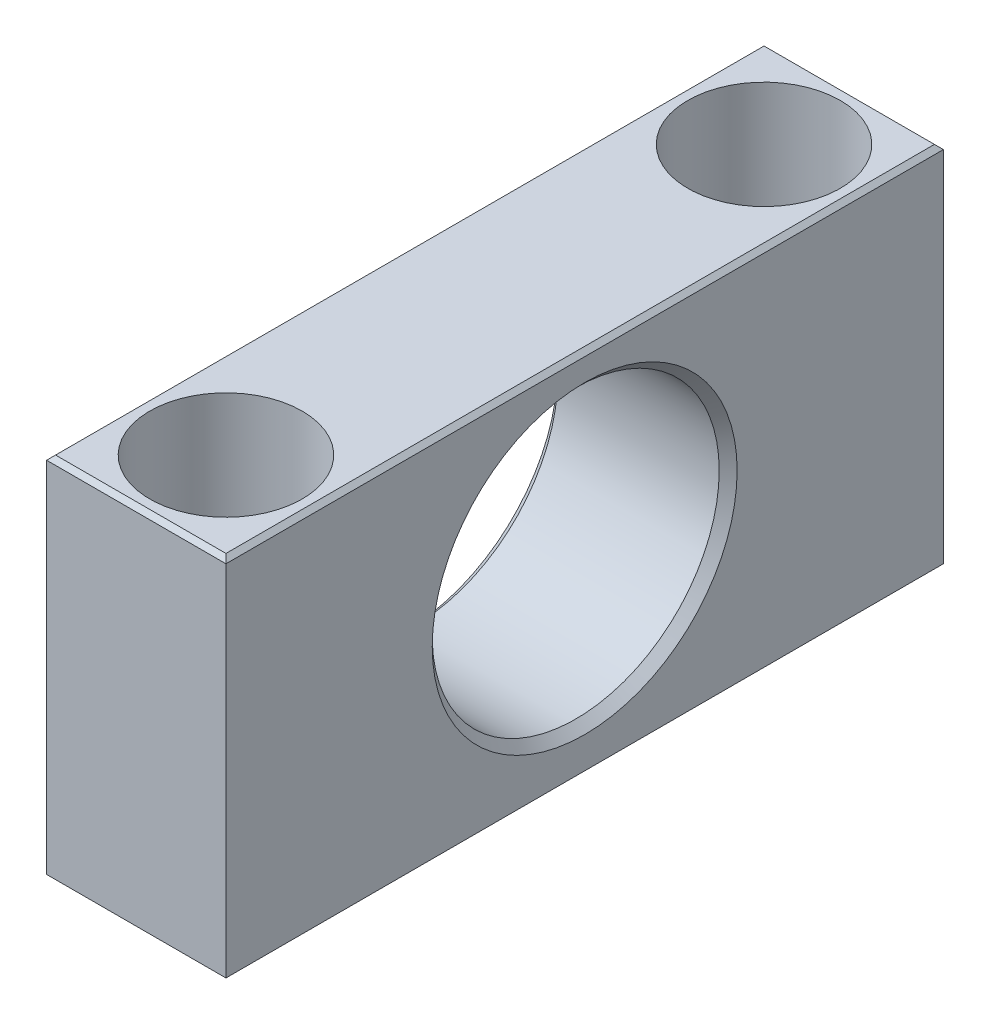
ISO-10303-21;
HEADER;
FILE_DESCRIPTION(('STEP AP214'),'2;1');
FILE_NAME('part.step','',(''),(''),'','','');
FILE_SCHEMA(('AUTOMOTIVE_DESIGN { 1 0 10303 214 1 1 1 1 }'));
ENDSEC;
DATA;
#1=APPLICATION_CONTEXT('core data for automotive mechanical design processes');
#2=APPLICATION_PROTOCOL_DEFINITION('international standard','automotive_design',2000,#1);
#3=PRODUCT_CONTEXT('',#1,'mechanical');
#4=PRODUCT('Part','Part','',(#3));
#5=PRODUCT_RELATED_PRODUCT_CATEGORY('part','',(#4));
#6=PRODUCT_DEFINITION_FORMATION('','',#4);
#7=PRODUCT_DEFINITION_CONTEXT('part definition',#1,'design');
#8=PRODUCT_DEFINITION('design','',#6,#7);
#9=PRODUCT_DEFINITION_SHAPE('','',#8);
#10=(LENGTH_UNIT() NAMED_UNIT(*) SI_UNIT(.MILLI.,.METRE.));
#11=(NAMED_UNIT(*) PLANE_ANGLE_UNIT() SI_UNIT($,.RADIAN.));
#12=(NAMED_UNIT(*) SI_UNIT($,.STERADIAN.) SOLID_ANGLE_UNIT());
#13=UNCERTAINTY_MEASURE_WITH_UNIT(LENGTH_MEASURE(1.E-05),#10,'distance_accuracy_value','');
#14=(GEOMETRIC_REPRESENTATION_CONTEXT(3) GLOBAL_UNCERTAINTY_ASSIGNED_CONTEXT((#13)) GLOBAL_UNIT_ASSIGNED_CONTEXT((#10,
#11,#12)) REPRESENTATION_CONTEXT('',''));
#15=CARTESIAN_POINT('',(0.,0.,0.));
#16=DIRECTION('',(0.,0.,1.));
#17=DIRECTION('',(1.,0.,0.));
#18=AXIS2_PLACEMENT_3D('',#15,#16,#17);
#19=CARTESIAN_POINT('',(17.,-1.,30.));
#20=DIRECTION('',(0.,-1.,0.));
#21=DIRECTION('',(0.,0.,-1.));
#22=AXIS2_PLACEMENT_3D('',#19,#20,#21);
#23=PLANE('',#22);
#24=CARTESIAN_POINT('',(10.,-1.,30.));
#25=DIRECTION('',(0.,-1.,0.));
#26=DIRECTION('',(0.,0.,-1.));
#27=AXIS2_PLACEMENT_3D('',#24,#25,#26);
#28=CIRCLE('',#27,5.5);
#29=CARTESIAN_POINT('',(10.,-1.,24.5));
#30=VERTEX_POINT('',#29);
#31=EDGE_CURVE('E145',#30,#30,#28,.T.);
#32=ORIENTED_EDGE('',*,*,#31,.T.);
#33=EDGE_LOOP('',(#32));
#34=FACE_BOUND('',#33,.T.);
#35=CARTESIAN_POINT('',(10.,-0.999999999999999,30.));
#36=DIRECTION('',(0.,-1.,0.));
#37=DIRECTION('',(0.,0.,-1.));
#38=AXIS2_PLACEMENT_3D('',#35,#36,#37);
#39=CIRCLE('',#38,8.5);
#40=CARTESIAN_POINT('',(10.,-0.999999999999999,21.5));
#41=VERTEX_POINT('',#40);
#42=EDGE_CURVE('E147',#41,#41,#39,.F.);
#43=ORIENTED_EDGE('',*,*,#42,.T.);
#44=EDGE_LOOP('',(#43));
#45=FACE_BOUND('',#44,.T.);
#46=ADVANCED_FACE('F17',(#34,#45),#23,.F.);
#47=CARTESIAN_POINT('',(17.,-1.,-30.));
#48=DIRECTION('',(0.,-1.,0.));
#49=DIRECTION('',(0.,0.,-1.));
#50=AXIS2_PLACEMENT_3D('',#47,#48,#49);
#51=PLANE('',#50);
#52=CARTESIAN_POINT('',(10.,-1.,-30.));
#53=DIRECTION('',(0.,-1.,0.));
#54=DIRECTION('',(0.,0.,-1.));
#55=AXIS2_PLACEMENT_3D('',#52,#53,#54);
#56=CIRCLE('',#55,5.5);
#57=CARTESIAN_POINT('',(10.,-1.,-35.5));
#58=VERTEX_POINT('',#57);
#59=EDGE_CURVE('E124',#58,#58,#56,.T.);
#60=ORIENTED_EDGE('',*,*,#59,.T.);
#61=EDGE_LOOP('',(#60));
#62=FACE_BOUND('',#61,.T.);
#63=CARTESIAN_POINT('',(10.,-0.999999999999999,-30.));
#64=DIRECTION('',(0.,-1.,0.));
#65=DIRECTION('',(0.,0.,-1.));
#66=AXIS2_PLACEMENT_3D('',#63,#64,#65);
#67=CIRCLE('',#66,8.5);
#68=CARTESIAN_POINT('',(10.,-0.999999999999999,-38.5));
#69=VERTEX_POINT('',#68);
#70=EDGE_CURVE('E20',#69,#69,#67,.F.);
#71=ORIENTED_EDGE('',*,*,#70,.T.);
#72=EDGE_LOOP('',(#71));
#73=FACE_BOUND('',#72,.T.);
#74=ADVANCED_FACE('F154',(#62,#73),#51,.F.);
#75=CARTESIAN_POINT('',(10.,9.5,-30.));
#76=DIRECTION('',(0.,-1.,0.));
#77=DIRECTION('',(0.,0.,-1.));
#78=AXIS2_PLACEMENT_3D('',#75,#76,#77);
#79=CYLINDRICAL_SURFACE('',#78,8.5);
#80=CARTESIAN_POINT('',(10.,20.,-30.));
#81=DIRECTION('',(0.,-1.,0.));
#82=DIRECTION('',(0.,0.,-1.));
#83=AXIS2_PLACEMENT_3D('',#80,#81,#82);
#84=CIRCLE('',#83,8.5);
#85=CARTESIAN_POINT('',(10.,20.,-38.5));
#86=VERTEX_POINT('',#85);
#87=EDGE_CURVE('E109',#86,#86,#84,.T.);
#88=ORIENTED_EDGE('',*,*,#87,.F.);
#89=EDGE_LOOP('',(#88));
#90=FACE_BOUND('',#89,.T.);
#91=ORIENTED_EDGE('',*,*,#70,.F.);
#92=EDGE_LOOP('',(#91));
#93=FACE_BOUND('',#92,.T.);
#94=ADVANCED_FACE('F156',(#90,#93),#79,.F.);
#95=CARTESIAN_POINT('',(10.,9.5,30.));
#96=DIRECTION('',(0.,-1.,0.));
#97=DIRECTION('',(0.,0.,-1.));
#98=AXIS2_PLACEMENT_3D('',#95,#96,#97);
#99=CYLINDRICAL_SURFACE('',#98,8.5);
#100=CARTESIAN_POINT('',(10.,20.,30.));
#101=DIRECTION('',(0.,-1.,0.));
#102=DIRECTION('',(0.,0.,-1.));
#103=AXIS2_PLACEMENT_3D('',#100,#101,#102);
#104=CIRCLE('',#103,8.5);
#105=CARTESIAN_POINT('',(10.,20.,21.5));
#106=VERTEX_POINT('',#105);
#107=EDGE_CURVE('E106',#106,#106,#104,.T.);
#108=ORIENTED_EDGE('',*,*,#107,.F.);
#109=EDGE_LOOP('',(#108));
#110=FACE_BOUND('',#109,.T.);
#111=ORIENTED_EDGE('',*,*,#42,.F.);
#112=EDGE_LOOP('',(#111));
#113=FACE_BOUND('',#112,.T.);
#114=ADVANCED_FACE('F158',(#110,#113),#99,.F.);
#115=CARTESIAN_POINT('',(0.,0.,0.));
#116=DIRECTION('',(-1.,0.,0.));
#117=DIRECTION('',(0.,0.,1.));
#118=AXIS2_PLACEMENT_3D('',#115,#116,#117);
#119=CONICAL_SURFACE('',#118,17.,0.785398163397448);
#120=CARTESIAN_POINT('',(0.,0.,0.));
#121=DIRECTION('',(-1.,0.,0.));
#122=DIRECTION('',(0.,0.,1.));
#123=AXIS2_PLACEMENT_3D('',#120,#121,#122);
#124=CIRCLE('',#123,17.);
#125=CARTESIAN_POINT('',(0.,0.,17.));
#126=VERTEX_POINT('',#125);
#127=EDGE_CURVE('E136',#126,#126,#124,.F.);
#128=ORIENTED_EDGE('',*,*,#127,.F.);
#129=EDGE_LOOP('',(#128));
#130=FACE_BOUND('',#129,.T.);
#131=CARTESIAN_POINT('',(0.999999999999999,0.,0.));
#132=DIRECTION('',(1.,0.,0.));
#133=DIRECTION('',(0.,0.,-1.));
#134=AXIS2_PLACEMENT_3D('',#131,#132,#133);
#135=CIRCLE('',#134,16.);
#136=CARTESIAN_POINT('',(0.999999999999999,0.,-16.));
#137=VERTEX_POINT('',#136);
#138=EDGE_CURVE('E94',#137,#137,#135,.T.);
#139=ORIENTED_EDGE('',*,*,#138,.T.);
#140=EDGE_LOOP('',(#139));
#141=FACE_BOUND('',#140,.T.);
#142=ADVANCED_FACE('F166',(#130,#141),#119,.F.);
#143=CARTESIAN_POINT('',(0.5,20.,40.));
#144=DIRECTION('',(-0.707106781186548,0.707106781186548,0.));
#145=DIRECTION('',(-0.707106781186548,-0.707106781186548,0.));
#146=AXIS2_PLACEMENT_3D('',#143,#144,#145);
#147=PLANE('',#146);
#148=DIRECTION('',(-0.577350269189626,-0.577350269189626,-0.577350269189626));
#149=VECTOR('',#148,1.);
#150=CARTESIAN_POINT('',(0.499999999999987,20.,-39.5));
#151=LINE('',#150,#149);
#152=CARTESIAN_POINT('',(0.499999999999993,20.,-39.5));
#153=VERTEX_POINT('',#152);
#154=CARTESIAN_POINT('',(0.,19.5,-40.));
#155=VERTEX_POINT('',#154);
#156=EDGE_CURVE('E85',#153,#155,#151,.T.);
#157=ORIENTED_EDGE('',*,*,#156,.T.);
#158=DIRECTION('',(0.,0.,1.));
#159=VECTOR('',#158,1.);
#160=CARTESIAN_POINT('',(0.,19.5,40.));
#161=LINE('',#160,#159);
#162=CARTESIAN_POINT('',(0.,19.5,40.));
#163=VERTEX_POINT('',#162);
#164=EDGE_CURVE('E481',#163,#155,#161,.F.);
#165=ORIENTED_EDGE('',*,*,#164,.F.);
#166=DIRECTION('',(0.577350269189626,0.577350269189626,-0.577350269189626));
#167=VECTOR('',#166,1.);
#168=CARTESIAN_POINT('',(0.,19.5,40.));
#169=LINE('',#168,#167);
#170=CARTESIAN_POINT('',(0.499999999999993,20.,39.5));
#171=VERTEX_POINT('',#170);
#172=EDGE_CURVE('E79',#163,#171,#169,.T.);
#173=ORIENTED_EDGE('',*,*,#172,.T.);
#174=DIRECTION('',(0.,0.,1.));
#175=VECTOR('',#174,1.);
#176=CARTESIAN_POINT('',(0.5,20.,40.));
#177=LINE('',#176,#175);
#178=EDGE_CURVE('E96',#153,#171,#177,.T.);
#179=ORIENTED_EDGE('',*,*,#178,.F.);
#180=EDGE_LOOP('',(#157,#165,#173,#179));
#181=FACE_BOUND('',#180,.T.);
#182=ADVANCED_FACE('F97',(#181),#147,.T.);
#183=CARTESIAN_POINT('',(0.,-20.5,40.));
#184=DIRECTION('',(-0.707106781186548,-0.707106781186548,0.));
#185=DIRECTION('',(0.707106781186548,-0.707106781186548,0.));
#186=AXIS2_PLACEMENT_3D('',#183,#184,#185);
#187=PLANE('',#186);
#188=DIRECTION('',(0.577350269189626,-0.577350269189626,0.577350269189626));
#189=VECTOR('',#188,1.);
#190=CARTESIAN_POINT('',(0.,-20.5,-40.));
#191=LINE('',#190,#189);
#192=CARTESIAN_POINT('',(0.,-20.5,-40.));
#193=VERTEX_POINT('',#192);
#194=CARTESIAN_POINT('',(0.499999999999985,-21.,-39.5));
#195=VERTEX_POINT('',#194);
#196=EDGE_CURVE('E115',#193,#195,#191,.T.);
#197=ORIENTED_EDGE('',*,*,#196,.T.);
#198=DIRECTION('',(0.,0.,-1.));
#199=VECTOR('',#198,1.);
#200=CARTESIAN_POINT('',(0.5,-21.,40.));
#201=LINE('',#200,#199);
#202=CARTESIAN_POINT('',(0.499999999999993,-21.,39.5));
#203=VERTEX_POINT('',#202);
#204=EDGE_CURVE('E135',#203,#195,#201,.T.);
#205=ORIENTED_EDGE('',*,*,#204,.F.);
#206=DIRECTION('',(-0.577350269189626,0.577350269189626,0.577350269189626));
#207=VECTOR('',#206,1.);
#208=CARTESIAN_POINT('',(0.499999999999987,-21.,39.5));
#209=LINE('',#208,#207);
#210=CARTESIAN_POINT('',(0.,-20.5,40.));
#211=VERTEX_POINT('',#210);
#212=EDGE_CURVE('E100',#203,#211,#209,.T.);
#213=ORIENTED_EDGE('',*,*,#212,.T.);
#214=DIRECTION('',(0.,0.,1.));
#215=VECTOR('',#214,1.);
#216=CARTESIAN_POINT('',(0.,-20.5,40.));
#217=LINE('',#216,#215);
#218=EDGE_CURVE('E138',#193,#211,#217,.T.);
#219=ORIENTED_EDGE('',*,*,#218,.F.);
#220=EDGE_LOOP('',(#197,#205,#213,#219));
#221=FACE_BOUND('',#220,.T.);
#222=ADVANCED_FACE('F234',(#221),#187,.T.);
#223=CARTESIAN_POINT('',(10.,-11.,30.));
#224=DIRECTION('',(0.,-1.,0.));
#225=DIRECTION('',(0.,0.,-1.));
#226=AXIS2_PLACEMENT_3D('',#223,#224,#225);
#227=CYLINDRICAL_SURFACE('',#226,5.5);
#228=CARTESIAN_POINT('',(10.,-21.,30.));
#229=DIRECTION('',(0.,-1.,0.));
#230=DIRECTION('',(0.,0.,-1.));
#231=AXIS2_PLACEMENT_3D('',#228,#229,#230);
#232=CIRCLE('',#231,5.5);
#233=CARTESIAN_POINT('',(10.,-21.,24.5));
#234=VERTEX_POINT('',#233);
#235=EDGE_CURVE('E132',#234,#234,#232,.F.);
#236=ORIENTED_EDGE('',*,*,#235,.F.);
#237=EDGE_LOOP('',(#236));
#238=FACE_BOUND('',#237,.T.);
#239=ORIENTED_EDGE('',*,*,#31,.F.);
#240=EDGE_LOOP('',(#239));
#241=FACE_BOUND('',#240,.T.);
#242=ADVANCED_FACE('F230',(#238,#241),#227,.F.);
#243=CARTESIAN_POINT('',(10.,-11.,-30.));
#244=DIRECTION('',(0.,-1.,0.));
#245=DIRECTION('',(0.,0.,-1.));
#246=AXIS2_PLACEMENT_3D('',#243,#244,#245);
#247=CYLINDRICAL_SURFACE('',#246,5.5);
#248=CARTESIAN_POINT('',(10.,-21.,-30.));
#249=DIRECTION('',(0.,-1.,0.));
#250=DIRECTION('',(0.,0.,-1.));
#251=AXIS2_PLACEMENT_3D('',#248,#249,#250);
#252=CIRCLE('',#251,5.5);
#253=CARTESIAN_POINT('',(10.,-21.,-35.5));
#254=VERTEX_POINT('',#253);
#255=EDGE_CURVE('E121',#254,#254,#252,.F.);
#256=ORIENTED_EDGE('',*,*,#255,.F.);
#257=EDGE_LOOP('',(#256));
#258=FACE_BOUND('',#257,.T.);
#259=ORIENTED_EDGE('',*,*,#59,.F.);
#260=EDGE_LOOP('',(#259));
#261=FACE_BOUND('',#260,.T.);
#262=ADVANCED_FACE('F226',(#258,#261),#247,.F.);
#263=CARTESIAN_POINT('',(10.,0.,0.));
#264=DIRECTION('',(1.,0.,0.));
#265=DIRECTION('',(0.,0.,-1.));
#266=AXIS2_PLACEMENT_3D('',#263,#264,#265);
#267=CYLINDRICAL_SURFACE('',#266,16.);
#268=CARTESIAN_POINT('',(19.,0.,0.));
#269=DIRECTION('',(1.,0.,0.));
#270=DIRECTION('',(0.,1.,0.));
#271=AXIS2_PLACEMENT_3D('',#268,#269,#270);
#272=CIRCLE('',#271,16.);
#273=CARTESIAN_POINT('',(19.,16.,0.));
#274=VERTEX_POINT('',#273);
#275=EDGE_CURVE('E118',#274,#274,#272,.T.);
#276=ORIENTED_EDGE('',*,*,#275,.T.);
#277=EDGE_LOOP('',(#276));
#278=FACE_BOUND('',#277,.T.);
#279=ORIENTED_EDGE('',*,*,#138,.F.);
#280=EDGE_LOOP('',(#279));
#281=FACE_BOUND('',#280,.T.);
#282=ADVANCED_FACE('F223',(#278,#281),#267,.F.);
#283=CARTESIAN_POINT('',(40.,20.,-39.5));
#284=DIRECTION('',(0.,-0.707106781186548,0.707106781186548));
#285=DIRECTION('',(0.,-0.707106781186548,-0.707106781186548));
#286=AXIS2_PLACEMENT_3D('',#283,#284,#285);
#287=PLANE('',#286);
#288=DIRECTION('',(1.,0.,0.));
#289=VECTOR('',#288,1.);
#290=CARTESIAN_POINT('',(0.,19.5,-40.));
#291=LINE('',#290,#289);
#292=CARTESIAN_POINT('',(20.,19.5,-40.));
#293=VERTEX_POINT('',#292);
#294=EDGE_CURVE('E91',#293,#155,#291,.F.);
#295=ORIENTED_EDGE('',*,*,#294,.T.);
#296=ORIENTED_EDGE('',*,*,#156,.F.);
#297=DIRECTION('',(1.,0.,0.));
#298=VECTOR('',#297,1.);
#299=CARTESIAN_POINT('',(19.5,20.,-39.5));
#300=LINE('',#299,#298);
#301=CARTESIAN_POINT('',(19.5,20.,-39.5));
#302=VERTEX_POINT('',#301);
#303=EDGE_CURVE('E88',#302,#153,#300,.F.);
#304=ORIENTED_EDGE('',*,*,#303,.F.);
#305=DIRECTION('',(-0.577350269189626,0.577350269189626,0.577350269189626));
#306=VECTOR('',#305,1.);
#307=CARTESIAN_POINT('',(20.,19.5,-40.));
#308=LINE('',#307,#306);
#309=EDGE_CURVE('E93',#293,#302,#308,.T.);
#310=ORIENTED_EDGE('',*,*,#309,.F.);
#311=EDGE_LOOP('',(#295,#296,#304,#310));
#312=FACE_BOUND('',#311,.T.);
#313=ADVANCED_FACE('F86',(#312),#287,.F.);
#314=CARTESIAN_POINT('',(40.,-20.5,-40.));
#315=DIRECTION('',(0.,0.707106781186548,0.707106781186548));
#316=DIRECTION('',(0.,-0.707106781186548,0.707106781186548));
#317=AXIS2_PLACEMENT_3D('',#314,#315,#316);
#318=PLANE('',#317);
#319=DIRECTION('',(1.,0.,0.));
#320=VECTOR('',#319,1.);
#321=CARTESIAN_POINT('',(0.5,-21.,-39.5));
#322=LINE('',#321,#320);
#323=CARTESIAN_POINT('',(19.5,-21.,-39.5));
#324=VERTEX_POINT('',#323);
#325=EDGE_CURVE('E476',#195,#324,#322,.T.);
#326=ORIENTED_EDGE('',*,*,#325,.F.);
#327=ORIENTED_EDGE('',*,*,#196,.F.);
#328=DIRECTION('',(1.,0.,0.));
#329=VECTOR('',#328,1.);
#330=CARTESIAN_POINT('',(0.,-20.5,-40.));
#331=LINE('',#330,#329);
#332=CARTESIAN_POINT('',(20.,-20.5,-40.));
#333=VERTEX_POINT('',#332);
#334=EDGE_CURVE('E512',#193,#333,#331,.T.);
#335=ORIENTED_EDGE('',*,*,#334,.T.);
#336=DIRECTION('',(0.577350269189626,0.577350269189626,-0.577350269189626));
#337=VECTOR('',#336,1.);
#338=CARTESIAN_POINT('',(19.5,-21.,-39.5));
#339=LINE('',#338,#337);
#340=EDGE_CURVE('E113',#324,#333,#339,.T.);
#341=ORIENTED_EDGE('',*,*,#340,.F.);
#342=EDGE_LOOP('',(#326,#327,#335,#341));
#343=FACE_BOUND('',#342,.T.);
#344=ADVANCED_FACE('F217',(#343),#318,.F.);
#345=CARTESIAN_POINT('',(19.5,20.,40.));
#346=DIRECTION('',(0.,1.,0.));
#347=DIRECTION('',(0.,0.,1.));
#348=AXIS2_PLACEMENT_3D('',#345,#346,#347);
#349=PLANE('',#348);
#350=DIRECTION('',(1.,0.,0.));
#351=VECTOR('',#350,1.);
#352=CARTESIAN_POINT('',(40.,20.,39.5));
#353=LINE('',#352,#351);
#354=CARTESIAN_POINT('',(19.5,20.,39.5));
#355=VERTEX_POINT('',#354);
#356=EDGE_CURVE('E139',#171,#355,#353,.T.);
#357=ORIENTED_EDGE('',*,*,#356,.T.);
#358=DIRECTION('',(0.,0.,1.));
#359=VECTOR('',#358,1.);
#360=CARTESIAN_POINT('',(19.5,20.,40.));
#361=LINE('',#360,#359);
#362=EDGE_CURVE('E105',#302,#355,#361,.T.);
#363=ORIENTED_EDGE('',*,*,#362,.F.);
#364=ORIENTED_EDGE('',*,*,#303,.T.);
#365=ORIENTED_EDGE('',*,*,#178,.T.);
#366=EDGE_LOOP('',(#357,#363,#364,#365));
#367=FACE_BOUND('',#366,.T.);
#368=ORIENTED_EDGE('',*,*,#107,.T.);
#369=EDGE_LOOP('',(#368));
#370=FACE_BOUND('',#369,.T.);
#371=ORIENTED_EDGE('',*,*,#87,.T.);
#372=EDGE_LOOP('',(#371));
#373=FACE_BOUND('',#372,.T.);
#374=ADVANCED_FACE('F102',(#367,#370,#373),#349,.T.);
#375=CARTESIAN_POINT('',(40.,-21.,39.5));
#376=DIRECTION('',(0.,0.707106781186548,-0.707106781186548));
#377=DIRECTION('',(0.,0.707106781186548,0.707106781186548));
#378=AXIS2_PLACEMENT_3D('',#375,#376,#377);
#379=PLANE('',#378);
#380=DIRECTION('',(1.,0.,0.));
#381=VECTOR('',#380,1.);
#382=CARTESIAN_POINT('',(0.,-20.5,40.));
#383=LINE('',#382,#381);
#384=CARTESIAN_POINT('',(20.,-20.5,40.));
#385=VERTEX_POINT('',#384);
#386=EDGE_CURVE('E492',#211,#385,#383,.T.);
#387=ORIENTED_EDGE('',*,*,#386,.F.);
#388=ORIENTED_EDGE('',*,*,#212,.F.);
#389=DIRECTION('',(1.,0.,0.));
#390=VECTOR('',#389,1.);
#391=CARTESIAN_POINT('',(0.5,-21.,39.5));
#392=LINE('',#391,#390);
#393=CARTESIAN_POINT('',(19.5,-21.,39.5));
#394=VERTEX_POINT('',#393);
#395=EDGE_CURVE('E480',#394,#203,#392,.F.);
#396=ORIENTED_EDGE('',*,*,#395,.F.);
#397=DIRECTION('',(-0.577350269189626,-0.577350269189626,-0.577350269189626));
#398=VECTOR('',#397,1.);
#399=CARTESIAN_POINT('',(20.,-20.5,40.));
#400=LINE('',#399,#398);
#401=EDGE_CURVE('E35',#385,#394,#400,.T.);
#402=ORIENTED_EDGE('',*,*,#401,.F.);
#403=EDGE_LOOP('',(#387,#388,#396,#402));
#404=FACE_BOUND('',#403,.T.);
#405=ADVANCED_FACE('F211',(#404),#379,.F.);
#406=CARTESIAN_POINT('',(40.,19.5,40.));
#407=DIRECTION('',(0.,-0.707106781186548,-0.707106781186548));
#408=DIRECTION('',(0.,0.707106781186548,-0.707106781186548));
#409=AXIS2_PLACEMENT_3D('',#406,#407,#408);
#410=PLANE('',#409);
#411=ORIENTED_EDGE('',*,*,#356,.F.);
#412=ORIENTED_EDGE('',*,*,#172,.F.);
#413=DIRECTION('',(1.,0.,0.));
#414=VECTOR('',#413,1.);
#415=CARTESIAN_POINT('',(0.,19.5,40.));
#416=LINE('',#415,#414);
#417=CARTESIAN_POINT('',(20.,19.5,40.));
#418=VERTEX_POINT('',#417);
#419=EDGE_CURVE('E496',#418,#163,#416,.F.);
#420=ORIENTED_EDGE('',*,*,#419,.F.);
#421=DIRECTION('',(0.577350269189626,-0.577350269189626,0.577350269189626));
#422=VECTOR('',#421,1.);
#423=CARTESIAN_POINT('',(19.5,20.,39.5));
#424=LINE('',#423,#422);
#425=EDGE_CURVE('E497',#355,#418,#424,.T.);
#426=ORIENTED_EDGE('',*,*,#425,.F.);
#427=EDGE_LOOP('',(#411,#412,#420,#426));
#428=FACE_BOUND('',#427,.T.);
#429=ADVANCED_FACE('F207',(#428),#410,.F.);
#430=CARTESIAN_POINT('',(0.,19.5,40.));
#431=DIRECTION('',(-1.,0.,0.));
#432=DIRECTION('',(0.,0.,1.));
#433=AXIS2_PLACEMENT_3D('',#430,#431,#432);
#434=PLANE('',#433);
#435=DIRECTION('',(0.,1.,0.));
#436=VECTOR('',#435,1.);
#437=CARTESIAN_POINT('',(0.,0.,40.));
#438=LINE('',#437,#436);
#439=EDGE_CURVE('E500',#163,#211,#438,.F.);
#440=ORIENTED_EDGE('',*,*,#439,.F.);
#441=ORIENTED_EDGE('',*,*,#164,.T.);
#442=DIRECTION('',(0.,1.,0.));
#443=VECTOR('',#442,1.);
#444=CARTESIAN_POINT('',(0.,0.,-40.));
#445=LINE('',#444,#443);
#446=EDGE_CURVE('E503',#155,#193,#445,.F.);
#447=ORIENTED_EDGE('',*,*,#446,.T.);
#448=ORIENTED_EDGE('',*,*,#218,.T.);
#449=EDGE_LOOP('',(#440,#441,#447,#448));
#450=FACE_BOUND('',#449,.T.);
#451=ORIENTED_EDGE('',*,*,#127,.T.);
#452=EDGE_LOOP('',(#451));
#453=FACE_BOUND('',#452,.T.);
#454=ADVANCED_FACE('F203',(#450,#453),#434,.T.);
#455=CARTESIAN_POINT('',(0.5,-21.,40.));
#456=DIRECTION('',(0.,-1.,0.));
#457=DIRECTION('',(0.,0.,-1.));
#458=AXIS2_PLACEMENT_3D('',#455,#456,#457);
#459=PLANE('',#458);
#460=ORIENTED_EDGE('',*,*,#255,.T.);
#461=EDGE_LOOP('',(#460));
#462=FACE_BOUND('',#461,.T.);
#463=ORIENTED_EDGE('',*,*,#235,.T.);
#464=EDGE_LOOP('',(#463));
#465=FACE_BOUND('',#464,.T.);
#466=ORIENTED_EDGE('',*,*,#395,.T.);
#467=ORIENTED_EDGE('',*,*,#204,.T.);
#468=ORIENTED_EDGE('',*,*,#325,.T.);
#469=DIRECTION('',(0.,0.,1.));
#470=VECTOR('',#469,1.);
#471=CARTESIAN_POINT('',(19.5,-21.,40.));
#472=LINE('',#471,#470);
#473=EDGE_CURVE('E129',#394,#324,#472,.F.);
#474=ORIENTED_EDGE('',*,*,#473,.F.);
#475=EDGE_LOOP('',(#466,#467,#468,#474));
#476=FACE_BOUND('',#475,.T.);
#477=ADVANCED_FACE('F199',(#462,#465,#476),#459,.T.);
#478=CARTESIAN_POINT('',(20.,0.,0.));
#479=DIRECTION('',(1.,0.,0.));
#480=DIRECTION('',(0.,0.,-1.));
#481=AXIS2_PLACEMENT_3D('',#478,#479,#480);
#482=CONICAL_SURFACE('',#481,17.,0.785398163397448);
#483=CARTESIAN_POINT('',(20.,0.,0.));
#484=DIRECTION('',(1.,0.,0.));
#485=DIRECTION('',(0.,0.,-1.));
#486=AXIS2_PLACEMENT_3D('',#483,#484,#485);
#487=CIRCLE('',#486,17.);
#488=CARTESIAN_POINT('',(20.,0.,-17.));
#489=VERTEX_POINT('',#488);
#490=EDGE_CURVE('E125',#489,#489,#487,.F.);
#491=ORIENTED_EDGE('',*,*,#490,.F.);
#492=EDGE_LOOP('',(#491));
#493=FACE_BOUND('',#492,.T.);
#494=ORIENTED_EDGE('',*,*,#275,.F.);
#495=EDGE_LOOP('',(#494));
#496=FACE_BOUND('',#495,.T.);
#497=ADVANCED_FACE('F195',(#493,#496),#482,.F.);
#498=CARTESIAN_POINT('',(0.,0.,-40.));
#499=DIRECTION('',(0.,0.,1.));
#500=DIRECTION('',(1.,0.,0.));
#501=AXIS2_PLACEMENT_3D('',#498,#499,#500);
#502=PLANE('',#501);
#503=ORIENTED_EDGE('',*,*,#446,.F.);
#504=ORIENTED_EDGE('',*,*,#294,.F.);
#505=DIRECTION('',(0.,1.,0.));
#506=VECTOR('',#505,1.);
#507=CARTESIAN_POINT('',(20.,-20.5,-40.));
#508=LINE('',#507,#506);
#509=EDGE_CURVE('E128',#333,#293,#508,.T.);
#510=ORIENTED_EDGE('',*,*,#509,.F.);
#511=ORIENTED_EDGE('',*,*,#334,.F.);
#512=EDGE_LOOP('',(#503,#504,#510,#511));
#513=FACE_BOUND('',#512,.T.);
#514=ADVANCED_FACE('F191',(#513),#502,.F.);
#515=CARTESIAN_POINT('',(20.,19.5,40.));
#516=DIRECTION('',(0.707106781186548,0.707106781186548,0.));
#517=DIRECTION('',(-0.707106781186548,0.707106781186548,0.));
#518=AXIS2_PLACEMENT_3D('',#515,#516,#517);
#519=PLANE('',#518);
#520=ORIENTED_EDGE('',*,*,#425,.T.);
#521=DIRECTION('',(0.,0.,-1.));
#522=VECTOR('',#521,1.);
#523=CARTESIAN_POINT('',(20.,19.5,40.));
#524=LINE('',#523,#522);
#525=EDGE_CURVE('E517',#293,#418,#524,.F.);
#526=ORIENTED_EDGE('',*,*,#525,.F.);
#527=ORIENTED_EDGE('',*,*,#309,.T.);
#528=ORIENTED_EDGE('',*,*,#362,.T.);
#529=EDGE_LOOP('',(#520,#526,#527,#528));
#530=FACE_BOUND('',#529,.T.);
#531=ADVANCED_FACE('F187',(#530),#519,.T.);
#532=CARTESIAN_POINT('',(0.,0.,40.));
#533=DIRECTION('',(0.,0.,1.));
#534=DIRECTION('',(1.,0.,0.));
#535=AXIS2_PLACEMENT_3D('',#532,#533,#534);
#536=PLANE('',#535);
#537=ORIENTED_EDGE('',*,*,#419,.T.);
#538=ORIENTED_EDGE('',*,*,#439,.T.);
#539=ORIENTED_EDGE('',*,*,#386,.T.);
#540=DIRECTION('',(0.,1.,0.));
#541=VECTOR('',#540,1.);
#542=CARTESIAN_POINT('',(20.,-20.5,40.));
#543=LINE('',#542,#541);
#544=EDGE_CURVE('E26',#418,#385,#543,.F.);
#545=ORIENTED_EDGE('',*,*,#544,.F.);
#546=EDGE_LOOP('',(#537,#538,#539,#545));
#547=FACE_BOUND('',#546,.T.);
#548=ADVANCED_FACE('F179',(#547),#536,.T.);
#549=CARTESIAN_POINT('',(19.5,-21.,40.));
#550=DIRECTION('',(0.707106781186548,-0.707106781186548,0.));
#551=DIRECTION('',(0.707106781186548,0.707106781186548,0.));
#552=AXIS2_PLACEMENT_3D('',#549,#550,#551);
#553=PLANE('',#552);
#554=ORIENTED_EDGE('',*,*,#401,.T.);
#555=ORIENTED_EDGE('',*,*,#473,.T.);
#556=ORIENTED_EDGE('',*,*,#340,.T.);
#557=DIRECTION('',(0.,0.,-1.));
#558=VECTOR('',#557,1.);
#559=CARTESIAN_POINT('',(20.,-20.5,40.));
#560=LINE('',#559,#558);
#561=EDGE_CURVE('E11',#385,#333,#560,.T.);
#562=ORIENTED_EDGE('',*,*,#561,.F.);
#563=EDGE_LOOP('',(#554,#555,#556,#562));
#564=FACE_BOUND('',#563,.T.);
#565=ADVANCED_FACE('F173',(#564),#553,.T.);
#566=CARTESIAN_POINT('',(20.,-20.5,40.));
#567=DIRECTION('',(1.,0.,0.));
#568=DIRECTION('',(0.,0.,-1.));
#569=AXIS2_PLACEMENT_3D('',#566,#567,#568);
#570=PLANE('',#569);
#571=ORIENTED_EDGE('',*,*,#544,.T.);
#572=ORIENTED_EDGE('',*,*,#561,.T.);
#573=ORIENTED_EDGE('',*,*,#509,.T.);
#574=ORIENTED_EDGE('',*,*,#525,.T.);
#575=EDGE_LOOP('',(#571,#572,#573,#574));
#576=FACE_BOUND('',#575,.T.);
#577=ORIENTED_EDGE('',*,*,#490,.T.);
#578=EDGE_LOOP('',(#577));
#579=FACE_BOUND('',#578,.T.);
#580=ADVANCED_FACE('F171',(#576,#579),#570,.T.);
#581=CLOSED_SHELL('',(#46,#74,#94,#114,#142,#182,#222,#242,#262,#282,#313,#344,#374,#405,#429,
#454,#477,#497,#514,#531,#548,#565,#580));
#582=MANIFOLD_SOLID_BREP('B1',#581);
#583=ADVANCED_BREP_SHAPE_REPRESENTATION('',(#18,#582),#14);
#584=SHAPE_DEFINITION_REPRESENTATION(#9,#583);
ENDSEC;
END-ISO-10303-21;
